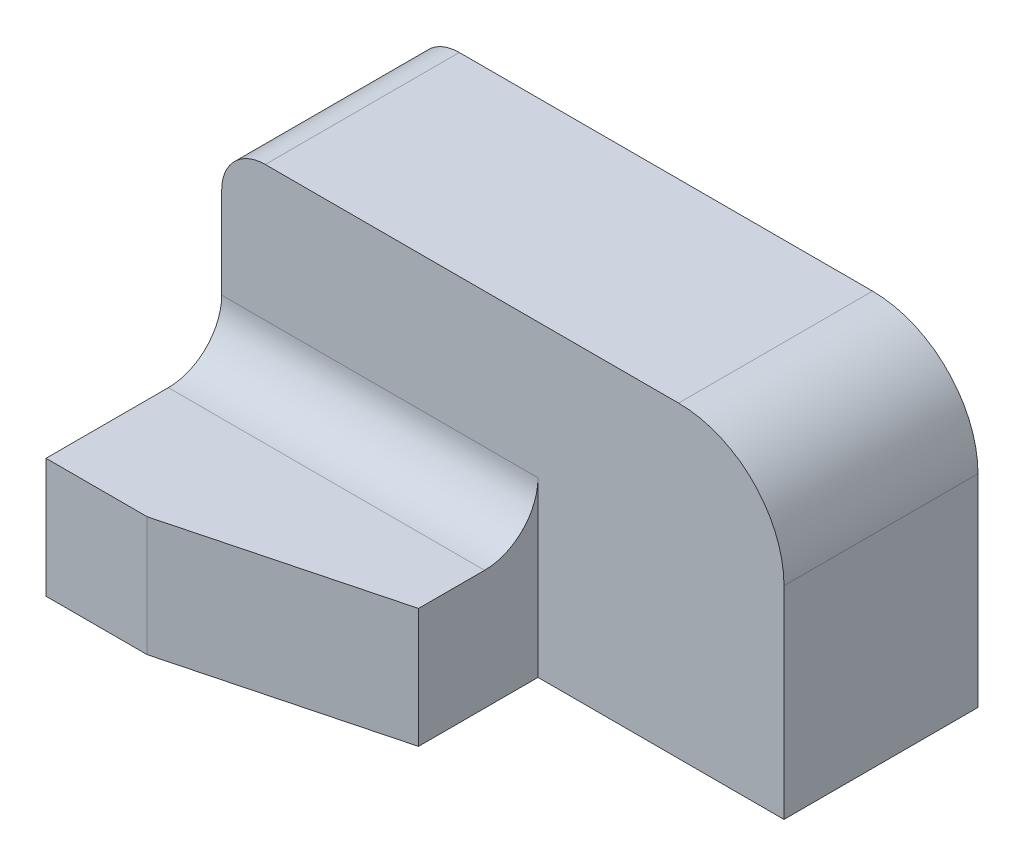
ISO-10303-21;
HEADER;
FILE_DESCRIPTION(('STEP AP214'),'2;1');
FILE_NAME('part.step','',(''),(''),'','','');
FILE_SCHEMA(('AUTOMOTIVE_DESIGN { 1 0 10303 214 1 1 1 1 }'));
ENDSEC;
DATA;
#1=APPLICATION_CONTEXT('core data for automotive mechanical design processes');
#2=APPLICATION_PROTOCOL_DEFINITION('international standard','automotive_design',2000,#1);
#3=PRODUCT_CONTEXT('',#1,'mechanical');
#4=PRODUCT('Part','Part','',(#3));
#5=PRODUCT_RELATED_PRODUCT_CATEGORY('part','',(#4));
#6=PRODUCT_DEFINITION_FORMATION('','',#4);
#7=PRODUCT_DEFINITION_CONTEXT('part definition',#1,'design');
#8=PRODUCT_DEFINITION('design','',#6,#7);
#9=PRODUCT_DEFINITION_SHAPE('','',#8);
#10=(LENGTH_UNIT() NAMED_UNIT(*) SI_UNIT(.MILLI.,.METRE.));
#11=(NAMED_UNIT(*) PLANE_ANGLE_UNIT() SI_UNIT($,.RADIAN.));
#12=(NAMED_UNIT(*) SI_UNIT($,.STERADIAN.) SOLID_ANGLE_UNIT());
#13=UNCERTAINTY_MEASURE_WITH_UNIT(LENGTH_MEASURE(1.E-05),#10,'distance_accuracy_value','');
#14=(GEOMETRIC_REPRESENTATION_CONTEXT(3) GLOBAL_UNCERTAINTY_ASSIGNED_CONTEXT((#13)) GLOBAL_UNIT_ASSIGNED_CONTEXT((#10,
#11,#12)) REPRESENTATION_CONTEXT('',''));
#15=CARTESIAN_POINT('',(0.,0.,0.));
#16=DIRECTION('',(0.,0.,1.));
#17=DIRECTION('',(1.,0.,0.));
#18=AXIS2_PLACEMENT_3D('',#15,#16,#17);
#19=CARTESIAN_POINT('',(0.,0.,35.052));
#20=DIRECTION('',(0.,0.,1.));
#21=DIRECTION('',(1.,0.,0.));
#22=AXIS2_PLACEMENT_3D('',#19,#20,#21);
#23=PLANE('',#22);
#24=DIRECTION('',(0.,1.,0.));
#25=VECTOR('',#24,1.);
#26=CARTESIAN_POINT('',(-101.6,0.,35.052));
#27=LINE('',#26,#25);
#28=CARTESIAN_POINT('',(-101.6,31.242,35.052));
#29=VERTEX_POINT('',#28);
#30=CARTESIAN_POINT('',(-101.6,47.7519999999999,35.052));
#31=VERTEX_POINT('',#30);
#32=EDGE_CURVE('E144',#29,#31,#27,.T.);
#33=ORIENTED_EDGE('',*,*,#32,.F.);
#34=DIRECTION('',(-1.,0.,0.));
#35=VECTOR('',#34,1.);
#36=CARTESIAN_POINT('',(-44.45,31.242,35.052));
#37=LINE('',#36,#35);
#38=CARTESIAN_POINT('',(-44.45,31.242,35.052));
#39=VERTEX_POINT('',#38);
#40=EDGE_CURVE('E185',#29,#39,#37,.F.);
#41=ORIENTED_EDGE('',*,*,#40,.T.);
#42=DIRECTION('',(0.,-1.,0.));
#43=VECTOR('',#42,1.);
#44=CARTESIAN_POINT('',(-44.45,0.,35.052));
#45=LINE('',#44,#43);
#46=CARTESIAN_POINT('',(-44.45,0.,35.052));
#47=VERTEX_POINT('',#46);
#48=EDGE_CURVE('E57',#39,#47,#45,.T.);
#49=ORIENTED_EDGE('',*,*,#48,.T.);
#50=DIRECTION('',(-1.,0.,0.));
#51=VECTOR('',#50,1.);
#52=CARTESIAN_POINT('',(0.,0.,35.052));
#53=LINE('',#52,#51);
#54=CARTESIAN_POINT('',(0.,0.,35.052));
#55=VERTEX_POINT('',#54);
#56=EDGE_CURVE('E133',#55,#47,#53,.T.);
#57=ORIENTED_EDGE('',*,*,#56,.F.);
#58=DIRECTION('',(0.,1.,0.));
#59=VECTOR('',#58,1.);
#60=CARTESIAN_POINT('',(0.,0.,35.052));
#61=LINE('',#60,#59);
#62=CARTESIAN_POINT('',(0.,36.576,35.052));
#63=VERTEX_POINT('',#62);
#64=EDGE_CURVE('E148',#55,#63,#61,.T.);
#65=ORIENTED_EDGE('',*,*,#64,.T.);
#66=CARTESIAN_POINT('',(-19.05,36.576,35.052));
#67=DIRECTION('',(0.,0.,1.));
#68=DIRECTION('',(1.,0.,0.));
#69=AXIS2_PLACEMENT_3D('',#66,#67,#68);
#70=CIRCLE('',#69,19.05);
#71=CARTESIAN_POINT('',(-19.05,55.626,35.052));
#72=VERTEX_POINT('',#71);
#73=EDGE_CURVE('E150',#63,#72,#70,.T.);
#74=ORIENTED_EDGE('',*,*,#73,.T.);
#75=DIRECTION('',(-1.,0.,0.));
#76=VECTOR('',#75,1.);
#77=CARTESIAN_POINT('',(0.,55.626,35.052));
#78=LINE('',#77,#76);
#79=CARTESIAN_POINT('',(-93.7259999999999,55.626,35.052));
#80=VERTEX_POINT('',#79);
#81=EDGE_CURVE('E152',#72,#80,#78,.T.);
#82=ORIENTED_EDGE('',*,*,#81,.T.);
#83=CARTESIAN_POINT('',(-93.726,47.752,35.052));
#84=DIRECTION('',(0.,0.,1.));
#85=DIRECTION('',(1.,0.,0.));
#86=AXIS2_PLACEMENT_3D('',#83,#84,#85);
#87=CIRCLE('',#86,7.874);
#88=EDGE_CURVE('E141',#31,#80,#87,.F.);
#89=ORIENTED_EDGE('',*,*,#88,.F.);
#90=EDGE_LOOP('',(#33,#41,#49,#57,#65,#74,#82,#89));
#91=FACE_BOUND('',#90,.T.);
#92=ADVANCED_FACE('F35',(#91),#23,.T.);
#93=CARTESIAN_POINT('',(-93.726,47.752,35.052));
#94=DIRECTION('',(0.,0.,-1.));
#95=DIRECTION('',(-1.,0.,0.));
#96=AXIS2_PLACEMENT_3D('',#93,#94,#95);
#97=CYLINDRICAL_SURFACE('',#96,7.874);
#98=CARTESIAN_POINT('',(-93.726,47.752,0.));
#99=DIRECTION('',(0.,0.,1.));
#100=DIRECTION('',(1.,0.,0.));
#101=AXIS2_PLACEMENT_3D('',#98,#99,#100);
#102=CIRCLE('',#101,7.874);
#103=CARTESIAN_POINT('',(-101.6,47.7519999999999,0.));
#104=VERTEX_POINT('',#103);
#105=CARTESIAN_POINT('',(-93.7259999999999,55.626,0.));
#106=VERTEX_POINT('',#105);
#107=EDGE_CURVE('E135',#104,#106,#102,.F.);
#108=ORIENTED_EDGE('',*,*,#107,.F.);
#109=DIRECTION('',(0.,0.,-1.));
#110=VECTOR('',#109,1.);
#111=CARTESIAN_POINT('',(-101.6,47.7519999999999,35.052));
#112=LINE('',#111,#110);
#113=EDGE_CURVE('E179',#31,#104,#112,.T.);
#114=ORIENTED_EDGE('',*,*,#113,.F.);
#115=ORIENTED_EDGE('',*,*,#88,.T.);
#116=DIRECTION('',(0.,0.,-1.));
#117=VECTOR('',#116,1.);
#118=CARTESIAN_POINT('',(-93.7259999999999,55.626,35.052));
#119=LINE('',#118,#117);
#120=EDGE_CURVE('E154',#80,#106,#119,.T.);
#121=ORIENTED_EDGE('',*,*,#120,.T.);
#122=EDGE_LOOP('',(#108,#114,#115,#121));
#123=FACE_BOUND('',#122,.T.);
#124=ADVANCED_FACE('F235',(#123),#97,.T.);
#125=CARTESIAN_POINT('',(-101.6,0.,35.052));
#126=DIRECTION('',(-1.,0.,0.));
#127=DIRECTION('',(0.,0.,1.));
#128=AXIS2_PLACEMENT_3D('',#125,#126,#127);
#129=PLANE('',#128);
#130=ORIENTED_EDGE('',*,*,#113,.T.);
#131=DIRECTION('',(0.,1.,0.));
#132=VECTOR('',#131,1.);
#133=CARTESIAN_POINT('',(-101.6,0.,0.));
#134=LINE('',#133,#132);
#135=CARTESIAN_POINT('',(-101.6,0.,0.));
#136=VERTEX_POINT('',#135);
#137=EDGE_CURVE('E157',#136,#104,#134,.T.);
#138=ORIENTED_EDGE('',*,*,#137,.F.);
#139=DIRECTION('',(0.,0.,-1.));
#140=VECTOR('',#139,1.);
#141=CARTESIAN_POINT('',(-101.6,0.,35.052));
#142=LINE('',#141,#140);
#143=CARTESIAN_POINT('',(-101.6,0.,66.802));
#144=VERTEX_POINT('',#143);
#145=EDGE_CURVE('E176',#144,#136,#142,.T.);
#146=ORIENTED_EDGE('',*,*,#145,.F.);
#147=DIRECTION('',(0.,1.,0.));
#148=VECTOR('',#147,1.);
#149=CARTESIAN_POINT('',(-101.6,0.,66.802));
#150=LINE('',#149,#148);
#151=CARTESIAN_POINT('',(-101.6,21.59,66.802));
#152=VERTEX_POINT('',#151);
#153=EDGE_CURVE('E209',#144,#152,#150,.T.);
#154=ORIENTED_EDGE('',*,*,#153,.T.);
#155=DIRECTION('',(0.,0.,-1.));
#156=VECTOR('',#155,1.);
#157=CARTESIAN_POINT('',(-101.6,21.59,66.802));
#158=LINE('',#157,#156);
#159=CARTESIAN_POINT('',(-101.6,21.59,44.704));
#160=VERTEX_POINT('',#159);
#161=EDGE_CURVE('E137',#152,#160,#158,.T.);
#162=ORIENTED_EDGE('',*,*,#161,.T.);
#163=CARTESIAN_POINT('',(-101.6,31.242,44.704));
#164=DIRECTION('',(-1.,0.,0.));
#165=DIRECTION('',(0.,0.,1.));
#166=AXIS2_PLACEMENT_3D('',#163,#164,#165);
#167=CIRCLE('',#166,9.652);
#168=EDGE_CURVE('E43',#160,#29,#167,.F.);
#169=ORIENTED_EDGE('',*,*,#168,.T.);
#170=ORIENTED_EDGE('',*,*,#32,.T.);
#171=EDGE_LOOP('',(#130,#138,#146,#154,#162,#169,#170));
#172=FACE_BOUND('',#171,.T.);
#173=ADVANCED_FACE('F189',(#172),#129,.T.);
#174=CARTESIAN_POINT('',(0.,0.,35.052));
#175=DIRECTION('',(0.,-1.,0.));
#176=DIRECTION('',(1.,0.,0.));
#177=AXIS2_PLACEMENT_3D('',#174,#175,#176);
#178=PLANE('',#177);
#179=DIRECTION('',(-0.967482832772027,0.,0.252936688306412));
#180=VECTOR('',#179,1.);
#181=CARTESIAN_POINT('',(-83.312,0.,66.802));
#182=LINE('',#181,#180);
#183=CARTESIAN_POINT('',(-44.45,0.,56.642));
#184=VERTEX_POINT('',#183);
#185=CARTESIAN_POINT('',(-83.312,0.,66.802));
#186=VERTEX_POINT('',#185);
#187=EDGE_CURVE('E116',#184,#186,#182,.T.);
#188=ORIENTED_EDGE('',*,*,#187,.T.);
#189=DIRECTION('',(-1.,0.,0.));
#190=VECTOR('',#189,1.);
#191=CARTESIAN_POINT('',(0.,0.,66.802));
#192=LINE('',#191,#190);
#193=EDGE_CURVE('E205',#186,#144,#192,.T.);
#194=ORIENTED_EDGE('',*,*,#193,.T.);
#195=ORIENTED_EDGE('',*,*,#145,.T.);
#196=DIRECTION('',(-1.,0.,0.));
#197=VECTOR('',#196,1.);
#198=CARTESIAN_POINT('',(0.,0.,0.));
#199=LINE('',#198,#197);
#200=CARTESIAN_POINT('',(0.,0.,0.));
#201=VERTEX_POINT('',#200);
#202=EDGE_CURVE('E159',#201,#136,#199,.T.);
#203=ORIENTED_EDGE('',*,*,#202,.F.);
#204=DIRECTION('',(0.,0.,-1.));
#205=VECTOR('',#204,1.);
#206=CARTESIAN_POINT('',(0.,0.,35.052));
#207=LINE('',#206,#205);
#208=EDGE_CURVE('E174',#55,#201,#207,.T.);
#209=ORIENTED_EDGE('',*,*,#208,.F.);
#210=ORIENTED_EDGE('',*,*,#56,.T.);
#211=DIRECTION('',(0.,0.,-1.));
#212=VECTOR('',#211,1.);
#213=CARTESIAN_POINT('',(-44.45,0.,66.802));
#214=LINE('',#213,#212);
#215=EDGE_CURVE('E127',#184,#47,#214,.T.);
#216=ORIENTED_EDGE('',*,*,#215,.F.);
#217=EDGE_LOOP('',(#188,#194,#195,#203,#209,#210,#216));
#218=FACE_BOUND('',#217,.T.);
#219=ADVANCED_FACE('F131',(#218),#178,.T.);
#220=CARTESIAN_POINT('',(0.,0.,35.052));
#221=DIRECTION('',(-1.,0.,0.));
#222=DIRECTION('',(0.,0.,1.));
#223=AXIS2_PLACEMENT_3D('',#220,#221,#222);
#224=PLANE('',#223);
#225=DIRECTION('',(0.,1.,0.));
#226=VECTOR('',#225,1.);
#227=CARTESIAN_POINT('',(0.,0.,0.));
#228=LINE('',#227,#226);
#229=CARTESIAN_POINT('',(0.,36.576,0.));
#230=VERTEX_POINT('',#229);
#231=EDGE_CURVE('E161',#201,#230,#228,.T.);
#232=ORIENTED_EDGE('',*,*,#231,.T.);
#233=DIRECTION('',(0.,0.,-1.));
#234=VECTOR('',#233,1.);
#235=CARTESIAN_POINT('',(0.,36.576,35.052));
#236=LINE('',#235,#234);
#237=EDGE_CURVE('E171',#63,#230,#236,.T.);
#238=ORIENTED_EDGE('',*,*,#237,.F.);
#239=ORIENTED_EDGE('',*,*,#64,.F.);
#240=ORIENTED_EDGE('',*,*,#208,.T.);
#241=EDGE_LOOP('',(#232,#238,#239,#240));
#242=FACE_BOUND('',#241,.T.);
#243=ADVANCED_FACE('F224',(#242),#224,.F.);
#244=CARTESIAN_POINT('',(-19.05,36.576,35.052));
#245=DIRECTION('',(0.,0.,-1.));
#246=DIRECTION('',(-1.,0.,0.));
#247=AXIS2_PLACEMENT_3D('',#244,#245,#246);
#248=CYLINDRICAL_SURFACE('',#247,19.05);
#249=CARTESIAN_POINT('',(-19.05,36.576,0.));
#250=DIRECTION('',(0.,0.,1.));
#251=DIRECTION('',(1.,0.,0.));
#252=AXIS2_PLACEMENT_3D('',#249,#250,#251);
#253=CIRCLE('',#252,19.05);
#254=CARTESIAN_POINT('',(-19.05,55.626,0.));
#255=VERTEX_POINT('',#254);
#256=EDGE_CURVE('E163',#230,#255,#253,.T.);
#257=ORIENTED_EDGE('',*,*,#256,.T.);
#258=DIRECTION('',(0.,0.,-1.));
#259=VECTOR('',#258,1.);
#260=CARTESIAN_POINT('',(-19.05,55.626,35.052));
#261=LINE('',#260,#259);
#262=EDGE_CURVE('E168',#72,#255,#261,.T.);
#263=ORIENTED_EDGE('',*,*,#262,.F.);
#264=ORIENTED_EDGE('',*,*,#73,.F.);
#265=ORIENTED_EDGE('',*,*,#237,.T.);
#266=EDGE_LOOP('',(#257,#263,#264,#265));
#267=FACE_BOUND('',#266,.T.);
#268=ADVANCED_FACE('F228',(#267),#248,.T.);
#269=CARTESIAN_POINT('',(0.,55.626,35.052));
#270=DIRECTION('',(0.,-1.,0.));
#271=DIRECTION('',(1.,0.,0.));
#272=AXIS2_PLACEMENT_3D('',#269,#270,#271);
#273=PLANE('',#272);
#274=DIRECTION('',(-1.,0.,0.));
#275=VECTOR('',#274,1.);
#276=CARTESIAN_POINT('',(0.,55.626,0.));
#277=LINE('',#276,#275);
#278=EDGE_CURVE('E145',#255,#106,#277,.T.);
#279=ORIENTED_EDGE('',*,*,#278,.T.);
#280=ORIENTED_EDGE('',*,*,#120,.F.);
#281=ORIENTED_EDGE('',*,*,#81,.F.);
#282=ORIENTED_EDGE('',*,*,#262,.T.);
#283=EDGE_LOOP('',(#279,#280,#281,#282));
#284=FACE_BOUND('',#283,.T.);
#285=ADVANCED_FACE('F233',(#284),#273,.F.);
#286=CARTESIAN_POINT('',(0.,0.,0.));
#287=DIRECTION('',(0.,0.,1.));
#288=DIRECTION('',(1.,0.,0.));
#289=AXIS2_PLACEMENT_3D('',#286,#287,#288);
#290=PLANE('',#289);
#291=ORIENTED_EDGE('',*,*,#202,.T.);
#292=ORIENTED_EDGE('',*,*,#137,.T.);
#293=ORIENTED_EDGE('',*,*,#107,.T.);
#294=ORIENTED_EDGE('',*,*,#278,.F.);
#295=ORIENTED_EDGE('',*,*,#256,.F.);
#296=ORIENTED_EDGE('',*,*,#231,.F.);
#297=EDGE_LOOP('',(#291,#292,#293,#294,#295,#296));
#298=FACE_BOUND('',#297,.T.);
#299=ADVANCED_FACE('F218',(#298),#290,.F.);
#300=CARTESIAN_POINT('',(-44.45,0.,66.802));
#301=DIRECTION('',(-1.,0.,0.));
#302=DIRECTION('',(0.,0.,1.));
#303=AXIS2_PLACEMENT_3D('',#300,#301,#302);
#304=PLANE('',#303);
#305=DIRECTION('',(0.,0.,-1.));
#306=VECTOR('',#305,1.);
#307=CARTESIAN_POINT('',(-44.45,21.59,66.802));
#308=LINE('',#307,#306);
#309=CARTESIAN_POINT('',(-44.45,21.59,56.642));
#310=VERTEX_POINT('',#309);
#311=CARTESIAN_POINT('',(-44.45,21.59,44.704));
#312=VERTEX_POINT('',#311);
#313=EDGE_CURVE('E128',#310,#312,#308,.T.);
#314=ORIENTED_EDGE('',*,*,#313,.F.);
#315=DIRECTION('',(0.,1.,0.));
#316=VECTOR('',#315,1.);
#317=CARTESIAN_POINT('',(-44.45,0.,56.642));
#318=LINE('',#317,#316);
#319=EDGE_CURVE('E119',#184,#310,#318,.T.);
#320=ORIENTED_EDGE('',*,*,#319,.F.);
#321=ORIENTED_EDGE('',*,*,#215,.T.);
#322=ORIENTED_EDGE('',*,*,#48,.F.);
#323=CARTESIAN_POINT('',(-44.45,31.242,44.704));
#324=DIRECTION('',(-1.,0.,0.));
#325=DIRECTION('',(0.,0.,1.));
#326=AXIS2_PLACEMENT_3D('',#323,#324,#325);
#327=CIRCLE('',#326,9.652);
#328=EDGE_CURVE('E11',#39,#312,#327,.T.);
#329=ORIENTED_EDGE('',*,*,#328,.T.);
#330=EDGE_LOOP('',(#314,#320,#321,#322,#329));
#331=FACE_BOUND('',#330,.T.);
#332=ADVANCED_FACE('F126',(#331),#304,.F.);
#333=CARTESIAN_POINT('',(0.,21.59,66.802));
#334=DIRECTION('',(0.,1.,0.));
#335=DIRECTION('',(-1.,0.,0.));
#336=AXIS2_PLACEMENT_3D('',#333,#334,#335);
#337=PLANE('',#336);
#338=DIRECTION('',(-0.967482832772027,0.,0.252936688306412));
#339=VECTOR('',#338,1.);
#340=CARTESIAN_POINT('',(-83.312,21.59,66.802));
#341=LINE('',#340,#339);
#342=CARTESIAN_POINT('',(-83.312,21.59,66.802));
#343=VERTEX_POINT('',#342);
#344=EDGE_CURVE('E50',#310,#343,#341,.T.);
#345=ORIENTED_EDGE('',*,*,#344,.F.);
#346=ORIENTED_EDGE('',*,*,#313,.T.);
#347=DIRECTION('',(-1.,0.,0.));
#348=VECTOR('',#347,1.);
#349=CARTESIAN_POINT('',(-101.6,21.59,44.704));
#350=LINE('',#349,#348);
#351=EDGE_CURVE('E182',#312,#160,#350,.T.);
#352=ORIENTED_EDGE('',*,*,#351,.T.);
#353=ORIENTED_EDGE('',*,*,#161,.F.);
#354=DIRECTION('',(1.,0.,0.));
#355=VECTOR('',#354,1.);
#356=CARTESIAN_POINT('',(0.,21.59,66.802));
#357=LINE('',#356,#355);
#358=EDGE_CURVE('E202',#152,#343,#357,.T.);
#359=ORIENTED_EDGE('',*,*,#358,.T.);
#360=EDGE_LOOP('',(#345,#346,#352,#353,#359));
#361=FACE_BOUND('',#360,.T.);
#362=ADVANCED_FACE('F199',(#361),#337,.T.);
#363=CARTESIAN_POINT('',(0.,0.,66.802));
#364=DIRECTION('',(0.,0.,1.));
#365=DIRECTION('',(1.,0.,0.));
#366=AXIS2_PLACEMENT_3D('',#363,#364,#365);
#367=PLANE('',#366);
#368=DIRECTION('',(0.,1.,0.));
#369=VECTOR('',#368,1.);
#370=CARTESIAN_POINT('',(-83.312,0.,66.802));
#371=LINE('',#370,#369);
#372=EDGE_CURVE('E120',#186,#343,#371,.T.);
#373=ORIENTED_EDGE('',*,*,#372,.T.);
#374=ORIENTED_EDGE('',*,*,#358,.F.);
#375=ORIENTED_EDGE('',*,*,#153,.F.);
#376=ORIENTED_EDGE('',*,*,#193,.F.);
#377=EDGE_LOOP('',(#373,#374,#375,#376));
#378=FACE_BOUND('',#377,.T.);
#379=ADVANCED_FACE('F214',(#378),#367,.T.);
#380=CARTESIAN_POINT('',(0.,31.242,44.704));
#381=DIRECTION('',(1.,0.,0.));
#382=DIRECTION('',(0.,1.,0.));
#383=AXIS2_PLACEMENT_3D('',#380,#381,#382);
#384=CYLINDRICAL_SURFACE('',#383,9.652);
#385=ORIENTED_EDGE('',*,*,#328,.F.);
#386=ORIENTED_EDGE('',*,*,#40,.F.);
#387=ORIENTED_EDGE('',*,*,#168,.F.);
#388=ORIENTED_EDGE('',*,*,#351,.F.);
#389=EDGE_LOOP('',(#385,#386,#387,#388));
#390=FACE_BOUND('',#389,.T.);
#391=ADVANCED_FACE('F37',(#390),#384,.F.);
#392=CARTESIAN_POINT('',(-83.312,0.,66.802));
#393=DIRECTION('',(-0.252936688306412,0.,-0.967482832772027));
#394=DIRECTION('',(-0.967482832772027,0.,0.252936688306412));
#395=AXIS2_PLACEMENT_3D('',#392,#393,#394);
#396=PLANE('',#395);
#397=ORIENTED_EDGE('',*,*,#344,.T.);
#398=ORIENTED_EDGE('',*,*,#372,.F.);
#399=ORIENTED_EDGE('',*,*,#187,.F.);
#400=ORIENTED_EDGE('',*,*,#319,.T.);
#401=EDGE_LOOP('',(#397,#398,#399,#400));
#402=FACE_BOUND('',#401,.T.);
#403=ADVANCED_FACE('F118',(#402),#396,.F.);
#404=CLOSED_SHELL('',(#92,#124,#173,#219,#243,#268,#285,#299,#332,#362,#379,#391,#403));
#405=MANIFOLD_SOLID_BREP('B2',#404);
#406=ADVANCED_BREP_SHAPE_REPRESENTATION('',(#18,#405),#14);
#407=SHAPE_DEFINITION_REPRESENTATION(#9,#406);
ENDSEC;
END-ISO-10303-21;
